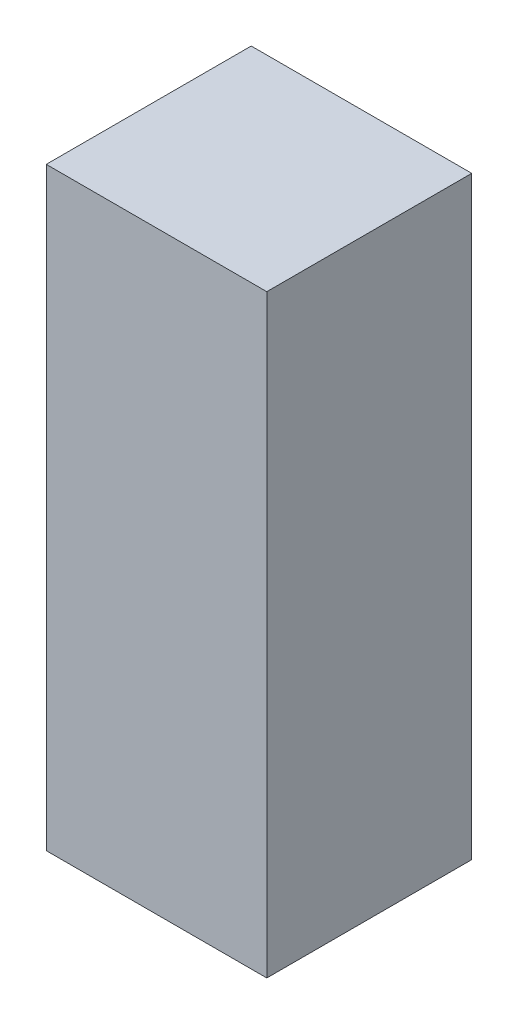
ISO-10303-21;
HEADER;
FILE_DESCRIPTION(('STEP AP214'),'2;1');
FILE_NAME('part.step','',(''),(''),'','','');
FILE_SCHEMA(('AUTOMOTIVE_DESIGN { 1 0 10303 214 1 1 1 1 }'));
ENDSEC;
DATA;
#1=APPLICATION_CONTEXT('core data for automotive mechanical design processes');
#2=APPLICATION_PROTOCOL_DEFINITION('international standard','automotive_design',2000,#1);
#3=PRODUCT_CONTEXT('',#1,'mechanical');
#4=PRODUCT('Part','Part','',(#3));
#5=PRODUCT_RELATED_PRODUCT_CATEGORY('part','',(#4));
#6=PRODUCT_DEFINITION_FORMATION('','',#4);
#7=PRODUCT_DEFINITION_CONTEXT('part definition',#1,'design');
#8=PRODUCT_DEFINITION('design','',#6,#7);
#9=PRODUCT_DEFINITION_SHAPE('','',#8);
#10=(LENGTH_UNIT() NAMED_UNIT(*) SI_UNIT(.MILLI.,.METRE.));
#11=(NAMED_UNIT(*) PLANE_ANGLE_UNIT() SI_UNIT($,.RADIAN.));
#12=(NAMED_UNIT(*) SI_UNIT($,.STERADIAN.) SOLID_ANGLE_UNIT());
#13=UNCERTAINTY_MEASURE_WITH_UNIT(LENGTH_MEASURE(1.E-05),#10,'distance_accuracy_value','');
#14=(GEOMETRIC_REPRESENTATION_CONTEXT(3) GLOBAL_UNCERTAINTY_ASSIGNED_CONTEXT((#13)) GLOBAL_UNIT_ASSIGNED_CONTEXT((#10,
#11,#12)) REPRESENTATION_CONTEXT('',''));
#15=CARTESIAN_POINT('',(0.,0.,0.));
#16=DIRECTION('',(0.,0.,1.));
#17=DIRECTION('',(1.,0.,0.));
#18=AXIS2_PLACEMENT_3D('',#15,#16,#17);
#19=CARTESIAN_POINT('',(-0.372,-0.725,0.5));
#20=DIRECTION('',(0.,0.,1.));
#21=DIRECTION('',(1.,0.,0.));
#22=AXIS2_PLACEMENT_3D('',#19,#20,#21);
#23=PLANE('',#22);
#24=DIRECTION('',(1.,0.,0.));
#25=VECTOR('',#24,1.);
#26=CARTESIAN_POINT('',(-0.372,0.725,0.5));
#27=LINE('',#26,#25);
#28=CARTESIAN_POINT('',(-0.372,0.725,0.5));
#29=VERTEX_POINT('',#28);
#30=CARTESIAN_POINT('',(0.166,0.725,0.5));
#31=VERTEX_POINT('',#30);
#32=EDGE_CURVE('E53',#29,#31,#27,.T.);
#33=ORIENTED_EDGE('',*,*,#32,.F.);
#34=DIRECTION('',(0.,1.,0.));
#35=VECTOR('',#34,1.);
#36=CARTESIAN_POINT('',(-0.372,-0.725,0.5));
#37=LINE('',#36,#35);
#38=CARTESIAN_POINT('',(-0.372,-0.725,0.5));
#39=VERTEX_POINT('',#38);
#40=EDGE_CURVE('E68',#39,#29,#37,.T.);
#41=ORIENTED_EDGE('',*,*,#40,.F.);
#42=DIRECTION('',(1.,0.,0.));
#43=VECTOR('',#42,1.);
#44=CARTESIAN_POINT('',(0.166,-0.725,0.5));
#45=LINE('',#44,#43);
#46=CARTESIAN_POINT('',(0.166,-0.725,0.5));
#47=VERTEX_POINT('',#46);
#48=EDGE_CURVE('E20',#47,#39,#45,.F.);
#49=ORIENTED_EDGE('',*,*,#48,.F.);
#50=DIRECTION('',(0.,1.,0.));
#51=VECTOR('',#50,1.);
#52=CARTESIAN_POINT('',(0.166,0.725,0.5));
#53=LINE('',#52,#51);
#54=EDGE_CURVE('E58',#31,#47,#53,.F.);
#55=ORIENTED_EDGE('',*,*,#54,.F.);
#56=EDGE_LOOP('',(#33,#41,#49,#55));
#57=FACE_BOUND('',#56,.T.);
#58=ADVANCED_FACE('F17',(#57),#23,.T.);
#59=CARTESIAN_POINT('',(0.166,-0.725,0.));
#60=DIRECTION('',(0.,-1.,0.));
#61=DIRECTION('',(0.,0.,-1.));
#62=AXIS2_PLACEMENT_3D('',#59,#60,#61);
#63=PLANE('',#62);
#64=DIRECTION('',(0.,0.,1.));
#65=VECTOR('',#64,1.);
#66=CARTESIAN_POINT('',(-0.372,-0.725,0.));
#67=LINE('',#66,#65);
#68=CARTESIAN_POINT('',(-0.372,-0.725,0.));
#69=VERTEX_POINT('',#68);
#70=EDGE_CURVE('E79',#69,#39,#67,.T.);
#71=ORIENTED_EDGE('',*,*,#70,.F.);
#72=DIRECTION('',(1.,0.,0.));
#73=VECTOR('',#72,1.);
#74=CARTESIAN_POINT('',(-0.372,-0.725,0.));
#75=LINE('',#74,#73);
#76=CARTESIAN_POINT('',(0.166,-0.725,0.));
#77=VERTEX_POINT('',#76);
#78=EDGE_CURVE('E74',#69,#77,#75,.T.);
#79=ORIENTED_EDGE('',*,*,#78,.T.);
#80=DIRECTION('',(0.,0.,-1.));
#81=VECTOR('',#80,1.);
#82=CARTESIAN_POINT('',(0.166,-0.725,0.));
#83=LINE('',#82,#81);
#84=EDGE_CURVE('E63',#47,#77,#83,.T.);
#85=ORIENTED_EDGE('',*,*,#84,.F.);
#86=ORIENTED_EDGE('',*,*,#48,.T.);
#87=EDGE_LOOP('',(#71,#79,#85,#86));
#88=FACE_BOUND('',#87,.T.);
#89=ADVANCED_FACE('F73',(#88),#63,.T.);
#90=CARTESIAN_POINT('',(0.166,0.725,0.));
#91=DIRECTION('',(1.,0.,0.));
#92=DIRECTION('',(0.,0.,-1.));
#93=AXIS2_PLACEMENT_3D('',#90,#91,#92);
#94=PLANE('',#93);
#95=ORIENTED_EDGE('',*,*,#84,.T.);
#96=DIRECTION('',(0.,1.,0.));
#97=VECTOR('',#96,1.);
#98=CARTESIAN_POINT('',(0.166,-0.725,0.));
#99=LINE('',#98,#97);
#100=CARTESIAN_POINT('',(0.166,0.725,0.));
#101=VERTEX_POINT('',#100);
#102=EDGE_CURVE('E84',#77,#101,#99,.T.);
#103=ORIENTED_EDGE('',*,*,#102,.T.);
#104=DIRECTION('',(0.,0.,1.));
#105=VECTOR('',#104,1.);
#106=CARTESIAN_POINT('',(0.166,0.725,0.));
#107=LINE('',#106,#105);
#108=EDGE_CURVE('E65',#31,#101,#107,.F.);
#109=ORIENTED_EDGE('',*,*,#108,.F.);
#110=ORIENTED_EDGE('',*,*,#54,.T.);
#111=EDGE_LOOP('',(#95,#103,#109,#110));
#112=FACE_BOUND('',#111,.T.);
#113=ADVANCED_FACE('F60',(#112),#94,.T.);
#114=CARTESIAN_POINT('',(-0.372,0.725,0.));
#115=DIRECTION('',(0.,1.,0.));
#116=DIRECTION('',(0.,0.,1.));
#117=AXIS2_PLACEMENT_3D('',#114,#115,#116);
#118=PLANE('',#117);
#119=ORIENTED_EDGE('',*,*,#108,.T.);
#120=DIRECTION('',(1.,0.,0.));
#121=VECTOR('',#120,1.);
#122=CARTESIAN_POINT('',(-0.372,0.725,0.));
#123=LINE('',#122,#121);
#124=CARTESIAN_POINT('',(-0.372,0.725,0.));
#125=VERTEX_POINT('',#124);
#126=EDGE_CURVE('E26',#101,#125,#123,.F.);
#127=ORIENTED_EDGE('',*,*,#126,.T.);
#128=DIRECTION('',(0.,0.,1.));
#129=VECTOR('',#128,1.);
#130=CARTESIAN_POINT('',(-0.372,0.725,0.));
#131=LINE('',#130,#129);
#132=EDGE_CURVE('E34',#29,#125,#131,.F.);
#133=ORIENTED_EDGE('',*,*,#132,.F.);
#134=ORIENTED_EDGE('',*,*,#32,.T.);
#135=EDGE_LOOP('',(#119,#127,#133,#134));
#136=FACE_BOUND('',#135,.T.);
#137=ADVANCED_FACE('F88',(#136),#118,.T.);
#138=CARTESIAN_POINT('',(-0.372,-0.725,0.));
#139=DIRECTION('',(-1.,0.,0.));
#140=DIRECTION('',(0.,0.,1.));
#141=AXIS2_PLACEMENT_3D('',#138,#139,#140);
#142=PLANE('',#141);
#143=ORIENTED_EDGE('',*,*,#132,.T.);
#144=DIRECTION('',(0.,1.,0.));
#145=VECTOR('',#144,1.);
#146=CARTESIAN_POINT('',(-0.372,-0.725,0.));
#147=LINE('',#146,#145);
#148=EDGE_CURVE('E11',#125,#69,#147,.F.);
#149=ORIENTED_EDGE('',*,*,#148,.T.);
#150=ORIENTED_EDGE('',*,*,#70,.T.);
#151=ORIENTED_EDGE('',*,*,#40,.T.);
#152=EDGE_LOOP('',(#143,#149,#150,#151));
#153=FACE_BOUND('',#152,.T.);
#154=ADVANCED_FACE('F91',(#153),#142,.T.);
#155=CARTESIAN_POINT('',(-0.372,-0.725,0.));
#156=DIRECTION('',(0.,0.,1.));
#157=DIRECTION('',(1.,0.,0.));
#158=AXIS2_PLACEMENT_3D('',#155,#156,#157);
#159=PLANE('',#158);
#160=ORIENTED_EDGE('',*,*,#126,.F.);
#161=ORIENTED_EDGE('',*,*,#102,.F.);
#162=ORIENTED_EDGE('',*,*,#78,.F.);
#163=ORIENTED_EDGE('',*,*,#148,.F.);
#164=EDGE_LOOP('',(#160,#161,#162,#163));
#165=FACE_BOUND('',#164,.T.);
#166=ADVANCED_FACE('F90',(#165),#159,.F.);
#167=CLOSED_SHELL('',(#58,#89,#113,#137,#154,#166));
#168=MANIFOLD_SOLID_BREP('B1',#167);
#169=ADVANCED_BREP_SHAPE_REPRESENTATION('',(#18,#168),#14);
#170=SHAPE_DEFINITION_REPRESENTATION(#9,#169);
ENDSEC;
END-ISO-10303-21;
